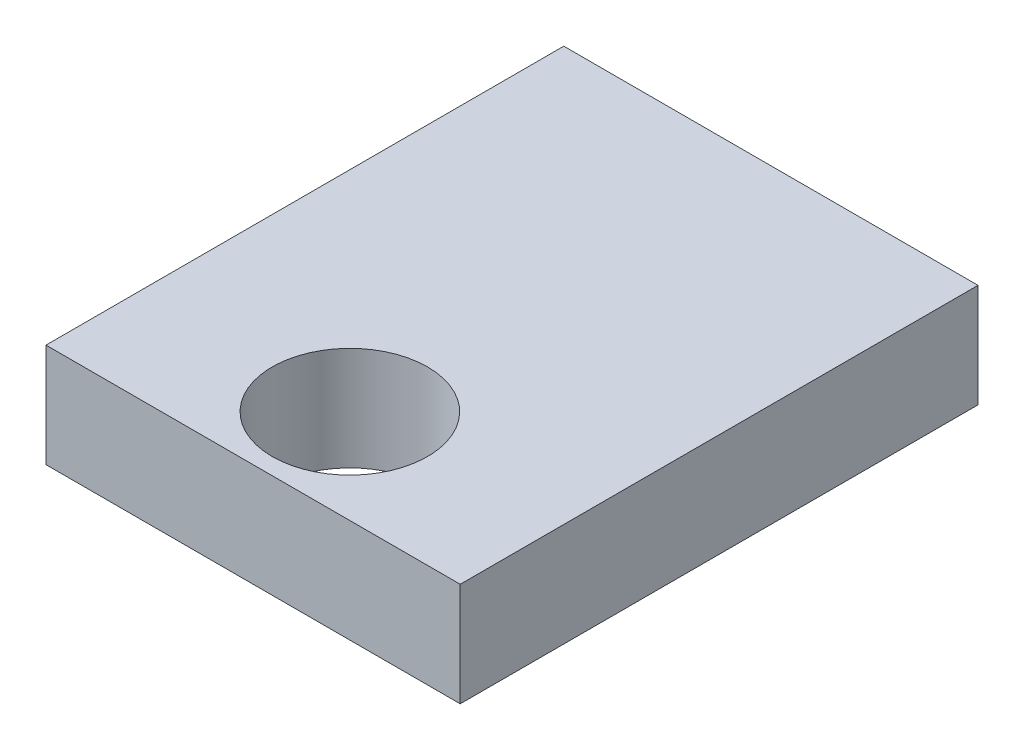
ISO-10303-21;
HEADER;
FILE_DESCRIPTION(('STEP AP214'),'2;1');
FILE_NAME('part.step','',(''),(''),'','','');
FILE_SCHEMA(('AUTOMOTIVE_DESIGN { 1 0 10303 214 1 1 1 1 }'));
ENDSEC;
DATA;
#1=APPLICATION_CONTEXT('core data for automotive mechanical design processes');
#2=APPLICATION_PROTOCOL_DEFINITION('international standard','automotive_design',2000,#1);
#3=PRODUCT_CONTEXT('',#1,'mechanical');
#4=PRODUCT('Part','Part','',(#3));
#5=PRODUCT_RELATED_PRODUCT_CATEGORY('part','',(#4));
#6=PRODUCT_DEFINITION_FORMATION('','',#4);
#7=PRODUCT_DEFINITION_CONTEXT('part definition',#1,'design');
#8=PRODUCT_DEFINITION('design','',#6,#7);
#9=PRODUCT_DEFINITION_SHAPE('','',#8);
#10=(LENGTH_UNIT() NAMED_UNIT(*) SI_UNIT(.MILLI.,.METRE.));
#11=(NAMED_UNIT(*) PLANE_ANGLE_UNIT() SI_UNIT($,.RADIAN.));
#12=(NAMED_UNIT(*) SI_UNIT($,.STERADIAN.) SOLID_ANGLE_UNIT());
#13=UNCERTAINTY_MEASURE_WITH_UNIT(LENGTH_MEASURE(1.E-05),#10,'distance_accuracy_value','');
#14=(GEOMETRIC_REPRESENTATION_CONTEXT(3) GLOBAL_UNCERTAINTY_ASSIGNED_CONTEXT((#13)) GLOBAL_UNIT_ASSIGNED_CONTEXT((#10,
#11,#12)) REPRESENTATION_CONTEXT('',''));
#15=CARTESIAN_POINT('',(0.,0.,0.));
#16=DIRECTION('',(0.,0.,1.));
#17=DIRECTION('',(1.,0.,0.));
#18=AXIS2_PLACEMENT_3D('',#15,#16,#17);
#19=CARTESIAN_POINT('',(-23.9717379938277,8.,-28.1507635082821));
#20=DIRECTION('',(0.,1.,0.));
#21=DIRECTION('',(0.,0.,1.));
#22=AXIS2_PLACEMENT_3D('',#19,#20,#21);
#23=PLANE('',#22);
#24=DIRECTION('',(0.,0.,1.));
#25=VECTOR('',#24,1.);
#26=CARTESIAN_POINT('',(-23.9717379938277,8.,-28.1507635082821));
#27=LINE('',#26,#25);
#28=CARTESIAN_POINT('',(-23.9717379938277,8.,-28.1507635082821));
#29=VERTEX_POINT('',#28);
#30=CARTESIAN_POINT('',(-23.9717379938277,8.,41.8492364917179));
#31=VERTEX_POINT('',#30);
#32=EDGE_CURVE('E91',#29,#31,#27,.T.);
#33=ORIENTED_EDGE('',*,*,#32,.T.);
#34=DIRECTION('',(1.,0.,0.));
#35=VECTOR('',#34,1.);
#36=CARTESIAN_POINT('',(-23.9717379938277,8.,41.8492364917179));
#37=LINE('',#36,#35);
#38=CARTESIAN_POINT('',(32.0282620061723,8.,41.8492364917179));
#39=VERTEX_POINT('',#38);
#40=EDGE_CURVE('E86',#31,#39,#37,.T.);
#41=ORIENTED_EDGE('',*,*,#40,.T.);
#42=DIRECTION('',(0.,0.,-1.));
#43=VECTOR('',#42,1.);
#44=CARTESIAN_POINT('',(32.0282620061723,8.,-28.1507635082821));
#45=LINE('',#44,#43);
#46=CARTESIAN_POINT('',(32.0282620061723,8.,-28.1507635082821));
#47=VERTEX_POINT('',#46);
#48=EDGE_CURVE('E89',#39,#47,#45,.T.);
#49=ORIENTED_EDGE('',*,*,#48,.T.);
#50=DIRECTION('',(-1.,0.,0.));
#51=VECTOR('',#50,1.);
#52=CARTESIAN_POINT('',(-23.9717379938277,8.,-28.1507635082821));
#53=LINE('',#52,#51);
#54=EDGE_CURVE('E56',#47,#29,#53,.T.);
#55=ORIENTED_EDGE('',*,*,#54,.T.);
#56=EDGE_LOOP('',(#33,#41,#49,#55));
#57=FACE_BOUND('',#56,.T.);
#58=CARTESIAN_POINT('',(4.36846022431123,8.,29.1090490317623));
#59=DIRECTION('',(0.,1.,0.));
#60=DIRECTION('',(0.,0.,1.));
#61=AXIS2_PLACEMENT_3D('',#58,#59,#60);
#62=CIRCLE('',#61,10.5);
#63=CARTESIAN_POINT('',(4.36846022431123,8.,39.6090490317623));
#64=VERTEX_POINT('',#63);
#65=EDGE_CURVE('E111',#64,#64,#62,.T.);
#66=ORIENTED_EDGE('',*,*,#65,.F.);
#67=EDGE_LOOP('',(#66));
#68=FACE_BOUND('',#67,.T.);
#69=ADVANCED_FACE('F38',(#57,#68),#23,.T.);
#70=CARTESIAN_POINT('',(-23.9717379938277,-6.,-28.1507635082821));
#71=DIRECTION('',(0.,1.,0.));
#72=DIRECTION('',(0.,0.,1.));
#73=AXIS2_PLACEMENT_3D('',#70,#71,#72);
#74=PLANE('',#73);
#75=DIRECTION('',(0.,0.,1.));
#76=VECTOR('',#75,1.);
#77=CARTESIAN_POINT('',(-23.9717379938277,-6.,-28.1507635082821));
#78=LINE('',#77,#76);
#79=CARTESIAN_POINT('',(-23.9717379938277,-6.,-28.1507635082821));
#80=VERTEX_POINT('',#79);
#81=CARTESIAN_POINT('',(-23.9717379938277,-6.,41.8492364917179));
#82=VERTEX_POINT('',#81);
#83=EDGE_CURVE('E107',#80,#82,#78,.T.);
#84=ORIENTED_EDGE('',*,*,#83,.F.);
#85=DIRECTION('',(-1.,0.,0.));
#86=VECTOR('',#85,1.);
#87=CARTESIAN_POINT('',(-23.9717379938277,-6.,-28.1507635082821));
#88=LINE('',#87,#86);
#89=CARTESIAN_POINT('',(32.0282620061723,-6.,-28.1507635082821));
#90=VERTEX_POINT('',#89);
#91=EDGE_CURVE('E79',#90,#80,#88,.T.);
#92=ORIENTED_EDGE('',*,*,#91,.F.);
#93=DIRECTION('',(0.,0.,-1.));
#94=VECTOR('',#93,1.);
#95=CARTESIAN_POINT('',(32.0282620061723,-6.,-28.1507635082821));
#96=LINE('',#95,#94);
#97=CARTESIAN_POINT('',(32.0282620061723,-6.,41.8492364917179));
#98=VERTEX_POINT('',#97);
#99=EDGE_CURVE('E73',#98,#90,#96,.T.);
#100=ORIENTED_EDGE('',*,*,#99,.F.);
#101=DIRECTION('',(1.,0.,0.));
#102=VECTOR('',#101,1.);
#103=CARTESIAN_POINT('',(-23.9717379938277,-6.,41.8492364917179));
#104=LINE('',#103,#102);
#105=EDGE_CURVE('E96',#82,#98,#104,.T.);
#106=ORIENTED_EDGE('',*,*,#105,.F.);
#107=EDGE_LOOP('',(#84,#92,#100,#106));
#108=FACE_BOUND('',#107,.T.);
#109=CARTESIAN_POINT('',(4.36846022431123,-6.,29.1090490317623));
#110=DIRECTION('',(0.,1.,0.));
#111=DIRECTION('',(0.,0.,1.));
#112=AXIS2_PLACEMENT_3D('',#109,#110,#111);
#113=CIRCLE('',#112,10.5);
#114=CARTESIAN_POINT('',(4.36846022431123,-6.,39.6090490317623));
#115=VERTEX_POINT('',#114);
#116=EDGE_CURVE('E129',#115,#115,#113,.T.);
#117=ORIENTED_EDGE('',*,*,#116,.T.);
#118=EDGE_LOOP('',(#117));
#119=FACE_BOUND('',#118,.T.);
#120=ADVANCED_FACE('F124',(#108,#119),#74,.F.);
#121=CARTESIAN_POINT('',(-23.9717379938277,8.,-28.1507635082821));
#122=DIRECTION('',(1.,0.,0.));
#123=DIRECTION('',(0.,0.,-1.));
#124=AXIS2_PLACEMENT_3D('',#121,#122,#123);
#125=PLANE('',#124);
#126=ORIENTED_EDGE('',*,*,#83,.T.);
#127=DIRECTION('',(0.,-1.,0.));
#128=VECTOR('',#127,1.);
#129=CARTESIAN_POINT('',(-23.9717379938277,8.,41.8492364917179));
#130=LINE('',#129,#128);
#131=EDGE_CURVE('E11',#31,#82,#130,.T.);
#132=ORIENTED_EDGE('',*,*,#131,.F.);
#133=ORIENTED_EDGE('',*,*,#32,.F.);
#134=DIRECTION('',(0.,-1.,0.));
#135=VECTOR('',#134,1.);
#136=CARTESIAN_POINT('',(-23.9717379938277,8.,-28.1507635082821));
#137=LINE('',#136,#135);
#138=EDGE_CURVE('E103',#29,#80,#137,.T.);
#139=ORIENTED_EDGE('',*,*,#138,.T.);
#140=EDGE_LOOP('',(#126,#132,#133,#139));
#141=FACE_BOUND('',#140,.T.);
#142=ADVANCED_FACE('F40',(#141),#125,.F.);
#143=CARTESIAN_POINT('',(-23.9717379938277,8.,41.8492364917179));
#144=DIRECTION('',(0.,0.,-1.));
#145=DIRECTION('',(-1.,0.,0.));
#146=AXIS2_PLACEMENT_3D('',#143,#144,#145);
#147=PLANE('',#146);
#148=ORIENTED_EDGE('',*,*,#105,.T.);
#149=DIRECTION('',(0.,-1.,0.));
#150=VECTOR('',#149,1.);
#151=CARTESIAN_POINT('',(32.0282620061723,8.,41.8492364917179));
#152=LINE('',#151,#150);
#153=EDGE_CURVE('E48',#39,#98,#152,.T.);
#154=ORIENTED_EDGE('',*,*,#153,.F.);
#155=ORIENTED_EDGE('',*,*,#40,.F.);
#156=ORIENTED_EDGE('',*,*,#131,.T.);
#157=EDGE_LOOP('',(#148,#154,#155,#156));
#158=FACE_BOUND('',#157,.T.);
#159=ADVANCED_FACE('F95',(#158),#147,.F.);
#160=CARTESIAN_POINT('',(32.0282620061723,8.,-28.1507635082821));
#161=DIRECTION('',(-1.,0.,0.));
#162=DIRECTION('',(0.,0.,1.));
#163=AXIS2_PLACEMENT_3D('',#160,#161,#162);
#164=PLANE('',#163);
#165=ORIENTED_EDGE('',*,*,#99,.T.);
#166=DIRECTION('',(0.,-1.,0.));
#167=VECTOR('',#166,1.);
#168=CARTESIAN_POINT('',(32.0282620061723,8.,-28.1507635082821));
#169=LINE('',#168,#167);
#170=EDGE_CURVE('E98',#47,#90,#169,.T.);
#171=ORIENTED_EDGE('',*,*,#170,.F.);
#172=ORIENTED_EDGE('',*,*,#48,.F.);
#173=ORIENTED_EDGE('',*,*,#153,.T.);
#174=EDGE_LOOP('',(#165,#171,#172,#173));
#175=FACE_BOUND('',#174,.T.);
#176=ADVANCED_FACE('F99',(#175),#164,.F.);
#177=CARTESIAN_POINT('',(-23.9717379938277,8.,-28.1507635082821));
#178=DIRECTION('',(0.,0.,1.));
#179=DIRECTION('',(1.,0.,0.));
#180=AXIS2_PLACEMENT_3D('',#177,#178,#179);
#181=PLANE('',#180);
#182=ORIENTED_EDGE('',*,*,#91,.T.);
#183=ORIENTED_EDGE('',*,*,#138,.F.);
#184=ORIENTED_EDGE('',*,*,#54,.F.);
#185=ORIENTED_EDGE('',*,*,#170,.T.);
#186=EDGE_LOOP('',(#182,#183,#184,#185));
#187=FACE_BOUND('',#186,.T.);
#188=ADVANCED_FACE('F121',(#187),#181,.F.);
#189=CARTESIAN_POINT('',(4.36846022431123,8.,29.1090490317623));
#190=DIRECTION('',(0.,-1.,0.));
#191=DIRECTION('',(0.,0.,-1.));
#192=AXIS2_PLACEMENT_3D('',#189,#190,#191);
#193=CYLINDRICAL_SURFACE('',#192,10.5);
#194=ORIENTED_EDGE('',*,*,#65,.T.);
#195=EDGE_LOOP('',(#194));
#196=FACE_BOUND('',#195,.T.);
#197=ORIENTED_EDGE('',*,*,#116,.F.);
#198=EDGE_LOOP('',(#197));
#199=FACE_BOUND('',#198,.T.);
#200=ADVANCED_FACE('F137',(#196,#199),#193,.F.);
#201=CLOSED_SHELL('',(#69,#120,#142,#159,#176,#188,#200));
#202=MANIFOLD_SOLID_BREP('B2',#201);
#203=ADVANCED_BREP_SHAPE_REPRESENTATION('',(#18,#202),#14);
#204=SHAPE_DEFINITION_REPRESENTATION(#9,#203);
ENDSEC;
END-ISO-10303-21;
